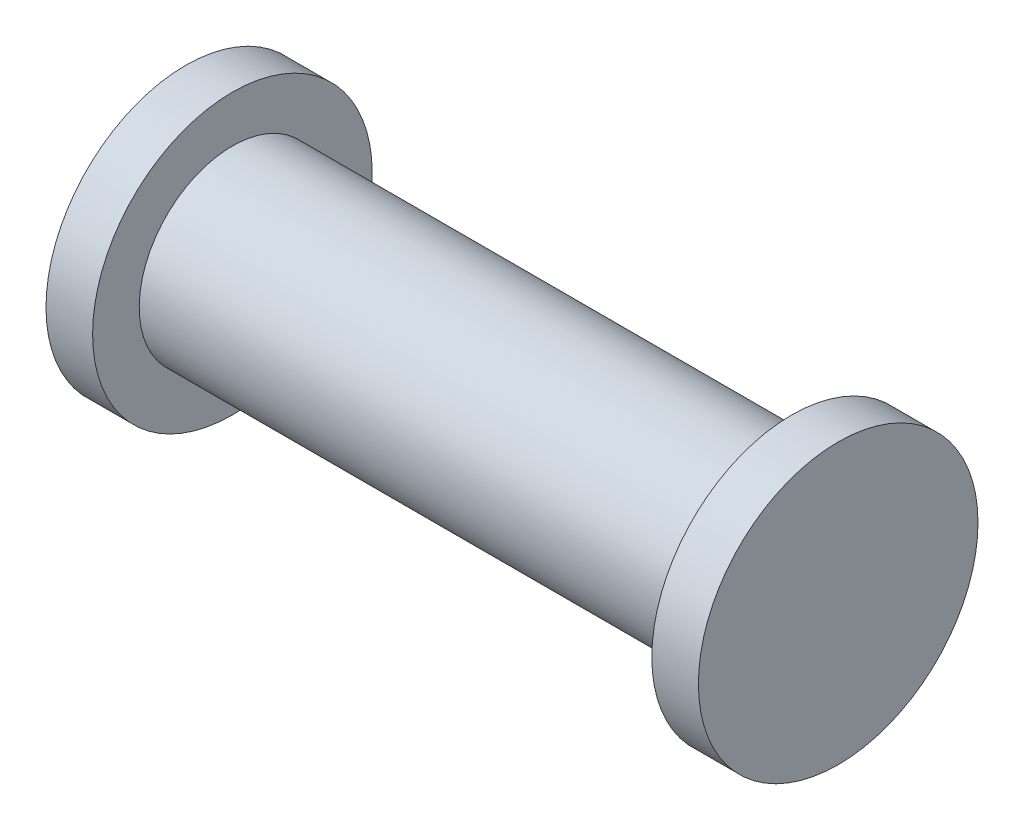
ISO-10303-21;
HEADER;
FILE_DESCRIPTION(('STEP AP214'),'2;1');
FILE_NAME('part.step','',(''),(''),'','','');
FILE_SCHEMA(('AUTOMOTIVE_DESIGN { 1 0 10303 214 1 1 1 1 }'));
ENDSEC;
DATA;
#1=APPLICATION_CONTEXT('core data for automotive mechanical design processes');
#2=APPLICATION_PROTOCOL_DEFINITION('international standard','automotive_design',2000,#1);
#3=PRODUCT_CONTEXT('',#1,'mechanical');
#4=PRODUCT('Part','Part','',(#3));
#5=PRODUCT_RELATED_PRODUCT_CATEGORY('part','',(#4));
#6=PRODUCT_DEFINITION_FORMATION('','',#4);
#7=PRODUCT_DEFINITION_CONTEXT('part definition',#1,'design');
#8=PRODUCT_DEFINITION('design','',#6,#7);
#9=PRODUCT_DEFINITION_SHAPE('','',#8);
#10=(LENGTH_UNIT() NAMED_UNIT(*) SI_UNIT(.MILLI.,.METRE.));
#11=(NAMED_UNIT(*) PLANE_ANGLE_UNIT() SI_UNIT($,.RADIAN.));
#12=(NAMED_UNIT(*) SI_UNIT($,.STERADIAN.) SOLID_ANGLE_UNIT());
#13=UNCERTAINTY_MEASURE_WITH_UNIT(LENGTH_MEASURE(1.E-05),#10,'distance_accuracy_value','');
#14=(GEOMETRIC_REPRESENTATION_CONTEXT(3) GLOBAL_UNCERTAINTY_ASSIGNED_CONTEXT((#13)) GLOBAL_UNIT_ASSIGNED_CONTEXT((#10,
#11,#12)) REPRESENTATION_CONTEXT('',''));
#15=CARTESIAN_POINT('',(0.,0.,0.));
#16=DIRECTION('',(0.,0.,1.));
#17=DIRECTION('',(1.,0.,0.));
#18=AXIS2_PLACEMENT_3D('',#15,#16,#17);
#19=CARTESIAN_POINT('',(0.,0.,0.));
#20=DIRECTION('',(1.,0.,0.));
#21=DIRECTION('',(0.,1.,0.));
#22=AXIS2_PLACEMENT_3D('',#19,#20,#21);
#23=PLANE('',#22);
#24=CARTESIAN_POINT('',(0.,0.,0.));
#25=DIRECTION('',(-1.,0.,0.));
#26=DIRECTION('',(0.,-1.,0.));
#27=AXIS2_PLACEMENT_3D('',#24,#25,#26);
#28=CIRCLE('',#27,1.50000000000001);
#29=CARTESIAN_POINT('',(0.,-1.50000000000002,0.));
#30=VERTEX_POINT('',#29);
#31=EDGE_CURVE('E10',#30,#30,#28,.T.);
#32=ORIENTED_EDGE('',*,*,#31,.T.);
#33=EDGE_LOOP('',(#32));
#34=FACE_BOUND('',#33,.T.);
#35=ADVANCED_FACE('F39',(#34),#23,.F.);
#36=CARTESIAN_POINT('',(6.5,0.,0.));
#37=DIRECTION('',(-1.,0.,0.));
#38=DIRECTION('',(0.,-1.,0.));
#39=AXIS2_PLACEMENT_3D('',#36,#37,#38);
#40=CYLINDRICAL_SURFACE('',#39,1.50000000000001);
#41=ORIENTED_EDGE('',*,*,#31,.F.);
#42=EDGE_LOOP('',(#41));
#43=FACE_BOUND('',#42,.T.);
#44=CARTESIAN_POINT('',(0.500000000000003,0.,0.));
#45=DIRECTION('',(-1.,0.,0.));
#46=DIRECTION('',(0.,-1.,0.));
#47=AXIS2_PLACEMENT_3D('',#44,#45,#46);
#48=CIRCLE('',#47,1.50000000000001);
#49=CARTESIAN_POINT('',(0.500000000000005,-1.50000000000002,0.));
#50=VERTEX_POINT('',#49);
#51=EDGE_CURVE('E46',#50,#50,#48,.T.);
#52=ORIENTED_EDGE('',*,*,#51,.T.);
#53=EDGE_LOOP('',(#52));
#54=FACE_BOUND('',#53,.T.);
#55=ADVANCED_FACE('F82',(#43,#54),#40,.T.);
#56=CARTESIAN_POINT('',(0.5,1.5,0.));
#57=DIRECTION('',(-1.,0.,0.));
#58=DIRECTION('',(0.,-1.,0.));
#59=AXIS2_PLACEMENT_3D('',#56,#57,#58);
#60=PLANE('',#59);
#61=ORIENTED_EDGE('',*,*,#51,.F.);
#62=EDGE_LOOP('',(#61));
#63=FACE_BOUND('',#62,.T.);
#64=CARTESIAN_POINT('',(0.500000000000002,0.,0.));
#65=DIRECTION('',(-1.,0.,0.));
#66=DIRECTION('',(0.,-1.,0.));
#67=AXIS2_PLACEMENT_3D('',#64,#65,#66);
#68=CIRCLE('',#67,1.00000000000001);
#69=CARTESIAN_POINT('',(0.500000000000004,-1.00000000000002,0.));
#70=VERTEX_POINT('',#69);
#71=EDGE_CURVE('E52',#70,#70,#68,.T.);
#72=ORIENTED_EDGE('',*,*,#71,.T.);
#73=EDGE_LOOP('',(#72));
#74=FACE_BOUND('',#73,.T.);
#75=ADVANCED_FACE('F85',(#63,#74),#60,.F.);
#76=CARTESIAN_POINT('',(6.5,0.,0.));
#77=DIRECTION('',(-1.,0.,0.));
#78=DIRECTION('',(0.,-1.,0.));
#79=AXIS2_PLACEMENT_3D('',#76,#77,#78);
#80=CYLINDRICAL_SURFACE('',#79,1.);
#81=ORIENTED_EDGE('',*,*,#71,.F.);
#82=EDGE_LOOP('',(#81));
#83=FACE_BOUND('',#82,.T.);
#84=CARTESIAN_POINT('',(6.5,0.,0.));
#85=DIRECTION('',(-1.,0.,0.));
#86=DIRECTION('',(0.,-1.,0.));
#87=AXIS2_PLACEMENT_3D('',#84,#85,#86);
#88=CIRCLE('',#87,1.);
#89=CARTESIAN_POINT('',(6.5,-1.,0.));
#90=VERTEX_POINT('',#89);
#91=EDGE_CURVE('E57',#90,#90,#88,.T.);
#92=ORIENTED_EDGE('',*,*,#91,.T.);
#93=EDGE_LOOP('',(#92));
#94=FACE_BOUND('',#93,.T.);
#95=ADVANCED_FACE('F89',(#83,#94),#80,.T.);
#96=CARTESIAN_POINT('',(6.5,1.,0.));
#97=DIRECTION('',(1.,0.,0.));
#98=DIRECTION('',(0.,1.,0.));
#99=AXIS2_PLACEMENT_3D('',#96,#97,#98);
#100=PLANE('',#99);
#101=ORIENTED_EDGE('',*,*,#91,.F.);
#102=EDGE_LOOP('',(#101));
#103=FACE_BOUND('',#102,.T.);
#104=CARTESIAN_POINT('',(6.5,0.,0.));
#105=DIRECTION('',(-1.,0.,0.));
#106=DIRECTION('',(0.,-1.,0.));
#107=AXIS2_PLACEMENT_3D('',#104,#105,#106);
#108=CIRCLE('',#107,1.5);
#109=CARTESIAN_POINT('',(6.50000000000001,-1.5,0.));
#110=VERTEX_POINT('',#109);
#111=EDGE_CURVE('E63',#110,#110,#108,.T.);
#112=ORIENTED_EDGE('',*,*,#111,.T.);
#113=EDGE_LOOP('',(#112));
#114=FACE_BOUND('',#113,.T.);
#115=ADVANCED_FACE('F78',(#103,#114),#100,.F.);
#116=CARTESIAN_POINT('',(6.5,0.,0.));
#117=DIRECTION('',(-1.,0.,0.));
#118=DIRECTION('',(0.,-1.,0.));
#119=AXIS2_PLACEMENT_3D('',#116,#117,#118);
#120=CYLINDRICAL_SURFACE('',#119,1.5);
#121=ORIENTED_EDGE('',*,*,#111,.F.);
#122=EDGE_LOOP('',(#121));
#123=FACE_BOUND('',#122,.T.);
#124=CARTESIAN_POINT('',(7.,0.,0.));
#125=DIRECTION('',(-1.,0.,0.));
#126=DIRECTION('',(0.,-1.,0.));
#127=AXIS2_PLACEMENT_3D('',#124,#125,#126);
#128=CIRCLE('',#127,1.5);
#129=CARTESIAN_POINT('',(7.00000000000001,-1.5,0.));
#130=VERTEX_POINT('',#129);
#131=EDGE_CURVE('E66',#130,#130,#128,.T.);
#132=ORIENTED_EDGE('',*,*,#131,.T.);
#133=EDGE_LOOP('',(#132));
#134=FACE_BOUND('',#133,.T.);
#135=ADVANCED_FACE('F71',(#123,#134),#120,.T.);
#136=CARTESIAN_POINT('',(7.,1.5,0.));
#137=DIRECTION('',(-1.,0.,0.));
#138=DIRECTION('',(0.,-1.,0.));
#139=AXIS2_PLACEMENT_3D('',#136,#137,#138);
#140=PLANE('',#139);
#141=ORIENTED_EDGE('',*,*,#131,.F.);
#142=EDGE_LOOP('',(#141));
#143=FACE_BOUND('',#142,.T.);
#144=ADVANCED_FACE('F73',(#143),#140,.F.);
#145=CLOSED_SHELL('',(#35,#55,#75,#95,#115,#135,#144));
#146=MANIFOLD_SOLID_BREP('B2',#145);
#147=ADVANCED_BREP_SHAPE_REPRESENTATION('',(#18,#146),#14);
#148=SHAPE_DEFINITION_REPRESENTATION(#9,#147);
ENDSEC;
END-ISO-10303-21;
